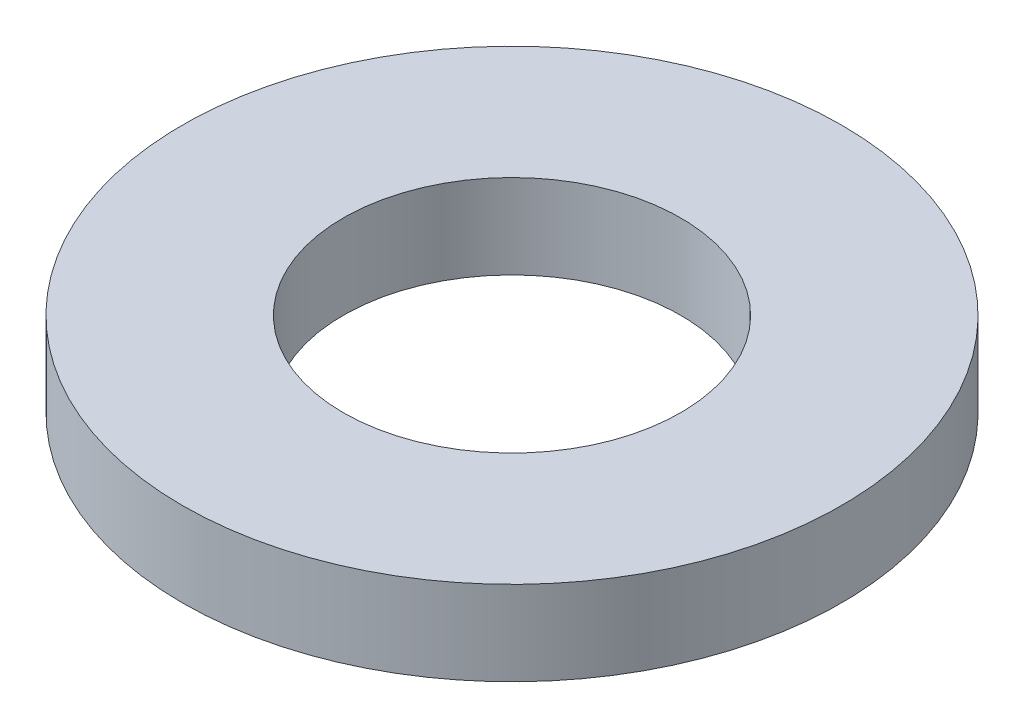
ISO-10303-21;
HEADER;
FILE_DESCRIPTION(('STEP AP214'),'2;1');
FILE_NAME('part.step','',(''),(''),'','','');
FILE_SCHEMA(('AUTOMOTIVE_DESIGN { 1 0 10303 214 1 1 1 1 }'));
ENDSEC;
DATA;
#1=APPLICATION_CONTEXT('core data for automotive mechanical design processes');
#2=APPLICATION_PROTOCOL_DEFINITION('international standard','automotive_design',2000,#1);
#3=PRODUCT_CONTEXT('',#1,'mechanical');
#4=PRODUCT('Part','Part','',(#3));
#5=PRODUCT_RELATED_PRODUCT_CATEGORY('part','',(#4));
#6=PRODUCT_DEFINITION_FORMATION('','',#4);
#7=PRODUCT_DEFINITION_CONTEXT('part definition',#1,'design');
#8=PRODUCT_DEFINITION('design','',#6,#7);
#9=PRODUCT_DEFINITION_SHAPE('','',#8);
#10=(LENGTH_UNIT() NAMED_UNIT(*) SI_UNIT(.MILLI.,.METRE.));
#11=(NAMED_UNIT(*) PLANE_ANGLE_UNIT() SI_UNIT($,.RADIAN.));
#12=(NAMED_UNIT(*) SI_UNIT($,.STERADIAN.) SOLID_ANGLE_UNIT());
#13=UNCERTAINTY_MEASURE_WITH_UNIT(LENGTH_MEASURE(1.E-05),#10,'distance_accuracy_value','');
#14=(GEOMETRIC_REPRESENTATION_CONTEXT(3) GLOBAL_UNCERTAINTY_ASSIGNED_CONTEXT((#13)) GLOBAL_UNIT_ASSIGNED_CONTEXT((#10,
#11,#12)) REPRESENTATION_CONTEXT('',''));
#15=CARTESIAN_POINT('',(0.,0.,0.));
#16=DIRECTION('',(0.,0.,1.));
#17=DIRECTION('',(1.,0.,0.));
#18=AXIS2_PLACEMENT_3D('',#15,#16,#17);
#19=CARTESIAN_POINT('',(0.,1.6,0.));
#20=DIRECTION('',(0.,1.,0.));
#21=DIRECTION('',(0.,0.,1.));
#22=AXIS2_PLACEMENT_3D('',#19,#20,#21);
#23=PLANE('',#22);
#24=CARTESIAN_POINT('',(0.,1.6,0.));
#25=DIRECTION('',(0.,1.,0.));
#26=DIRECTION('',(0.,0.,1.));
#27=AXIS2_PLACEMENT_3D('',#24,#25,#26);
#28=CIRCLE('',#27,6.25);
#29=CARTESIAN_POINT('',(0.,1.6,6.25));
#30=VERTEX_POINT('',#29);
#31=EDGE_CURVE('E10',#30,#30,#28,.T.);
#32=ORIENTED_EDGE('',*,*,#31,.T.);
#33=EDGE_LOOP('',(#32));
#34=FACE_BOUND('',#33,.T.);
#35=CARTESIAN_POINT('',(0.,1.6,0.));
#36=DIRECTION('',(0.,1.,0.));
#37=DIRECTION('',(0.,0.,1.));
#38=AXIS2_PLACEMENT_3D('',#35,#36,#37);
#39=CIRCLE('',#38,3.2);
#40=CARTESIAN_POINT('',(0.,1.6,3.2));
#41=VERTEX_POINT('',#40);
#42=EDGE_CURVE('E43',#41,#41,#39,.T.);
#43=ORIENTED_EDGE('',*,*,#42,.F.);
#44=EDGE_LOOP('',(#43));
#45=FACE_BOUND('',#44,.T.);
#46=ADVANCED_FACE('F32',(#34,#45),#23,.T.);
#47=CARTESIAN_POINT('',(0.,0.,0.));
#48=DIRECTION('',(0.,1.,0.));
#49=DIRECTION('',(0.,0.,1.));
#50=AXIS2_PLACEMENT_3D('',#47,#48,#49);
#51=PLANE('',#50);
#52=CARTESIAN_POINT('',(0.,0.,0.));
#53=DIRECTION('',(0.,1.,0.));
#54=DIRECTION('',(0.,0.,1.));
#55=AXIS2_PLACEMENT_3D('',#52,#53,#54);
#56=CIRCLE('',#55,6.25);
#57=CARTESIAN_POINT('',(0.,0.,6.25));
#58=VERTEX_POINT('',#57);
#59=EDGE_CURVE('E36',#58,#58,#56,.T.);
#60=ORIENTED_EDGE('',*,*,#59,.F.);
#61=EDGE_LOOP('',(#60));
#62=FACE_BOUND('',#61,.T.);
#63=CARTESIAN_POINT('',(0.,0.,0.));
#64=DIRECTION('',(0.,1.,0.));
#65=DIRECTION('',(0.,0.,1.));
#66=AXIS2_PLACEMENT_3D('',#63,#64,#65);
#67=CIRCLE('',#66,3.2);
#68=CARTESIAN_POINT('',(0.,0.,3.2));
#69=VERTEX_POINT('',#68);
#70=EDGE_CURVE('E45',#69,#69,#67,.T.);
#71=ORIENTED_EDGE('',*,*,#70,.T.);
#72=EDGE_LOOP('',(#71));
#73=FACE_BOUND('',#72,.T.);
#74=ADVANCED_FACE('F55',(#62,#73),#51,.F.);
#75=CARTESIAN_POINT('',(0.,1.6,0.));
#76=DIRECTION('',(0.,-1.,0.));
#77=DIRECTION('',(0.,0.,-1.));
#78=AXIS2_PLACEMENT_3D('',#75,#76,#77);
#79=CYLINDRICAL_SURFACE('',#78,6.25);
#80=ORIENTED_EDGE('',*,*,#31,.F.);
#81=EDGE_LOOP('',(#80));
#82=FACE_BOUND('',#81,.T.);
#83=ORIENTED_EDGE('',*,*,#59,.T.);
#84=EDGE_LOOP('',(#83));
#85=FACE_BOUND('',#84,.T.);
#86=ADVANCED_FACE('F34',(#82,#85),#79,.T.);
#87=CARTESIAN_POINT('',(0.,1.6,0.));
#88=DIRECTION('',(0.,-1.,0.));
#89=DIRECTION('',(0.,0.,-1.));
#90=AXIS2_PLACEMENT_3D('',#87,#88,#89);
#91=CYLINDRICAL_SURFACE('',#90,3.2);
#92=ORIENTED_EDGE('',*,*,#42,.T.);
#93=EDGE_LOOP('',(#92));
#94=FACE_BOUND('',#93,.T.);
#95=ORIENTED_EDGE('',*,*,#70,.F.);
#96=EDGE_LOOP('',(#95));
#97=FACE_BOUND('',#96,.T.);
#98=ADVANCED_FACE('F51',(#94,#97),#91,.F.);
#99=CLOSED_SHELL('',(#46,#74,#86,#98));
#100=MANIFOLD_SOLID_BREP('B2',#99);
#101=ADVANCED_BREP_SHAPE_REPRESENTATION('',(#18,#100),#14);
#102=SHAPE_DEFINITION_REPRESENTATION(#9,#101);
ENDSEC;
END-ISO-10303-21;
